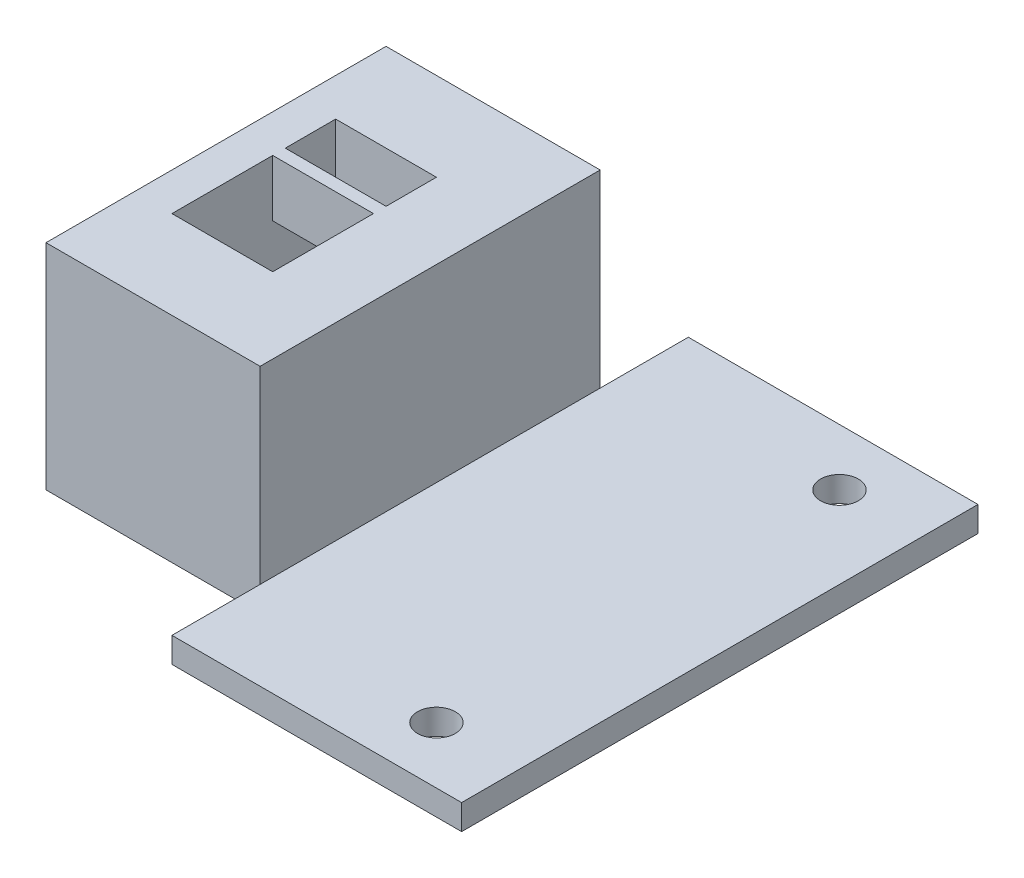
ISO-10303-21;
HEADER;
FILE_DESCRIPTION(('STEP AP214'),'2;1');
FILE_NAME('part.step','',(''),(''),'','','');
FILE_SCHEMA(('AUTOMOTIVE_DESIGN { 1 0 10303 214 1 1 1 1 }'));
ENDSEC;
DATA;
#1=APPLICATION_CONTEXT('core data for automotive mechanical design processes');
#2=APPLICATION_PROTOCOL_DEFINITION('international standard','automotive_design',2000,#1);
#3=PRODUCT_CONTEXT('',#1,'mechanical');
#4=PRODUCT('Part','Part','',(#3));
#5=PRODUCT_RELATED_PRODUCT_CATEGORY('part','',(#4));
#6=PRODUCT_DEFINITION_FORMATION('','',#4);
#7=PRODUCT_DEFINITION_CONTEXT('part definition',#1,'design');
#8=PRODUCT_DEFINITION('design','',#6,#7);
#9=PRODUCT_DEFINITION_SHAPE('','',#8);
#10=(LENGTH_UNIT() NAMED_UNIT(*) SI_UNIT(.MILLI.,.METRE.));
#11=(NAMED_UNIT(*) PLANE_ANGLE_UNIT() SI_UNIT($,.RADIAN.));
#12=(NAMED_UNIT(*) SI_UNIT($,.STERADIAN.) SOLID_ANGLE_UNIT());
#13=UNCERTAINTY_MEASURE_WITH_UNIT(LENGTH_MEASURE(1.E-05),#10,'distance_accuracy_value','');
#14=(GEOMETRIC_REPRESENTATION_CONTEXT(3) GLOBAL_UNCERTAINTY_ASSIGNED_CONTEXT((#13)) GLOBAL_UNIT_ASSIGNED_CONTEXT((#10,
#11,#12)) REPRESENTATION_CONTEXT('',''));
#15=CARTESIAN_POINT('',(0.,0.,0.));
#16=DIRECTION('',(0.,0.,1.));
#17=DIRECTION('',(1.,0.,0.));
#18=AXIS2_PLACEMENT_3D('',#15,#16,#17);
#19=CARTESIAN_POINT('',(-65.3730576602029,23.1868131868132,41.));
#20=DIRECTION('',(1.,0.,0.));
#21=DIRECTION('',(0.,0.,-1.));
#22=AXIS2_PLACEMENT_3D('',#19,#20,#21);
#23=PLANE('',#22);
#24=DIRECTION('',(0.,0.,-1.));
#25=VECTOR('',#24,1.);
#26=CARTESIAN_POINT('',(-65.3730576602029,23.1868131868132,41.));
#27=LINE('',#26,#25);
#28=CARTESIAN_POINT('',(-65.3730576602029,23.1868131868132,34.));
#29=VERTEX_POINT('',#28);
#30=CARTESIAN_POINT('',(-65.3730576602029,23.1868131868132,7.));
#31=VERTEX_POINT('',#30);
#32=EDGE_CURVE('E269',#29,#31,#27,.T.);
#33=ORIENTED_EDGE('',*,*,#32,.T.);
#34=DIRECTION('',(0.,-1.,0.));
#35=VECTOR('',#34,1.);
#36=CARTESIAN_POINT('',(-65.3730576602029,23.1868131868132,7.));
#37=LINE('',#36,#35);
#38=CARTESIAN_POINT('',(-65.3730576602029,6.18681318681318,7.));
#39=VERTEX_POINT('',#38);
#40=EDGE_CURVE('E193',#31,#39,#37,.T.);
#41=ORIENTED_EDGE('',*,*,#40,.T.);
#42=DIRECTION('',(0.,0.,-1.));
#43=VECTOR('',#42,1.);
#44=CARTESIAN_POINT('',(-65.3730576602029,6.18681318681318,41.));
#45=LINE('',#44,#43);
#46=CARTESIAN_POINT('',(-65.3730576602029,6.18681318681318,34.));
#47=VERTEX_POINT('',#46);
#48=EDGE_CURVE('E289',#47,#39,#45,.T.);
#49=ORIENTED_EDGE('',*,*,#48,.F.);
#50=DIRECTION('',(0.,-1.,0.));
#51=VECTOR('',#50,1.);
#52=CARTESIAN_POINT('',(-65.3730576602029,23.1868131868132,34.));
#53=LINE('',#52,#51);
#54=EDGE_CURVE('E206',#29,#47,#53,.T.);
#55=ORIENTED_EDGE('',*,*,#54,.F.);
#56=EDGE_LOOP('',(#33,#41,#49,#55));
#57=FACE_BOUND('',#56,.T.);
#58=ADVANCED_FACE('F33',(#57),#23,.F.);
#59=CARTESIAN_POINT('',(-25.3730576602029,6.18681318681318,41.));
#60=DIRECTION('',(0.,1.,0.));
#61=DIRECTION('',(0.,0.,1.));
#62=AXIS2_PLACEMENT_3D('',#59,#60,#61);
#63=PLANE('',#62);
#64=DIRECTION('',(0.,0.,-1.));
#65=VECTOR('',#64,1.);
#66=CARTESIAN_POINT('',(-62.3730576602029,6.18681318681318,27.));
#67=LINE('',#66,#65);
#68=CARTESIAN_POINT('',(-62.3730576602029,6.18681318681318,27.));
#69=VERTEX_POINT('',#68);
#70=CARTESIAN_POINT('',(-62.3730576602029,6.18681318681318,14.));
#71=VERTEX_POINT('',#70);
#72=EDGE_CURVE('E232',#69,#71,#67,.T.);
#73=ORIENTED_EDGE('',*,*,#72,.F.);
#74=DIRECTION('',(-1.,0.,0.));
#75=VECTOR('',#74,1.);
#76=CARTESIAN_POINT('',(-62.3730576602029,6.18681318681318,27.));
#77=LINE('',#76,#75);
#78=CARTESIAN_POINT('',(-54.3730576602029,6.18681318681318,27.));
#79=VERTEX_POINT('',#78);
#80=EDGE_CURVE('E214',#79,#69,#77,.T.);
#81=ORIENTED_EDGE('',*,*,#80,.F.);
#82=DIRECTION('',(0.,0.,1.));
#83=VECTOR('',#82,1.);
#84=CARTESIAN_POINT('',(-54.3730576602029,6.18681318681318,27.));
#85=LINE('',#84,#83);
#86=CARTESIAN_POINT('',(-54.3730576602029,6.18681318681318,14.));
#87=VERTEX_POINT('',#86);
#88=EDGE_CURVE('E221',#87,#79,#85,.T.);
#89=ORIENTED_EDGE('',*,*,#88,.F.);
#90=DIRECTION('',(1.,0.,0.));
#91=VECTOR('',#90,1.);
#92=CARTESIAN_POINT('',(-62.3730576602029,6.18681318681318,14.));
#93=LINE('',#92,#91);
#94=EDGE_CURVE('E235',#71,#87,#93,.T.);
#95=ORIENTED_EDGE('',*,*,#94,.F.);
#96=EDGE_LOOP('',(#73,#81,#89,#95));
#97=FACE_BOUND('',#96,.T.);
#98=CARTESIAN_POINT('',(-31.8730576602029,6.18681318681318,4.5));
#99=DIRECTION('',(0.,-1.,0.));
#100=DIRECTION('',(0.,0.,-1.));
#101=AXIS2_PLACEMENT_3D('',#98,#99,#100);
#102=CIRCLE('',#101,1.5);
#103=CARTESIAN_POINT('',(-31.8730576602029,6.18681318681318,3.));
#104=VERTEX_POINT('',#103);
#105=EDGE_CURVE('E242',#104,#104,#102,.T.);
#106=ORIENTED_EDGE('',*,*,#105,.F.);
#107=EDGE_LOOP('',(#106));
#108=FACE_BOUND('',#107,.T.);
#109=CARTESIAN_POINT('',(-31.8730576602029,6.18681318681318,36.5));
#110=DIRECTION('',(0.,-1.,0.));
#111=DIRECTION('',(0.,0.,-1.));
#112=AXIS2_PLACEMENT_3D('',#109,#110,#111);
#113=CIRCLE('',#112,1.5);
#114=CARTESIAN_POINT('',(-31.8730576602029,6.18681318681318,35.));
#115=VERTEX_POINT('',#114);
#116=EDGE_CURVE('E252',#115,#115,#113,.T.);
#117=ORIENTED_EDGE('',*,*,#116,.F.);
#118=EDGE_LOOP('',(#117));
#119=FACE_BOUND('',#118,.T.);
#120=ORIENTED_EDGE('',*,*,#48,.T.);
#121=DIRECTION('',(-1.,0.,0.));
#122=VECTOR('',#121,1.);
#123=CARTESIAN_POINT('',(-65.3730576602029,6.18681318681318,7.));
#124=LINE('',#123,#122);
#125=CARTESIAN_POINT('',(-48.3730576602029,6.18681318681318,7.));
#126=VERTEX_POINT('',#125);
#127=EDGE_CURVE('E189',#126,#39,#124,.T.);
#128=ORIENTED_EDGE('',*,*,#127,.F.);
#129=DIRECTION('',(0.,0.,1.));
#130=VECTOR('',#129,1.);
#131=CARTESIAN_POINT('',(-48.3730576602029,6.18681318681318,0.));
#132=LINE('',#131,#130);
#133=CARTESIAN_POINT('',(-48.3730576602029,6.18681318681318,0.));
#134=VERTEX_POINT('',#133);
#135=EDGE_CURVE('E180',#134,#126,#132,.T.);
#136=ORIENTED_EDGE('',*,*,#135,.F.);
#137=DIRECTION('',(1.,0.,0.));
#138=VECTOR('',#137,1.);
#139=CARTESIAN_POINT('',(-25.3730576602029,6.18681318681318,0.));
#140=LINE('',#139,#138);
#141=CARTESIAN_POINT('',(-25.3730576602029,6.18681318681318,0.));
#142=VERTEX_POINT('',#141);
#143=EDGE_CURVE('E258',#134,#142,#140,.T.);
#144=ORIENTED_EDGE('',*,*,#143,.T.);
#145=DIRECTION('',(0.,0.,-1.));
#146=VECTOR('',#145,1.);
#147=CARTESIAN_POINT('',(-25.3730576602029,6.18681318681318,41.));
#148=LINE('',#147,#146);
#149=CARTESIAN_POINT('',(-25.3730576602029,6.18681318681318,41.));
#150=VERTEX_POINT('',#149);
#151=EDGE_CURVE('E286',#150,#142,#148,.T.);
#152=ORIENTED_EDGE('',*,*,#151,.F.);
#153=DIRECTION('',(1.,0.,0.));
#154=VECTOR('',#153,1.);
#155=CARTESIAN_POINT('',(-25.3730576602029,6.18681318681318,41.));
#156=LINE('',#155,#154);
#157=CARTESIAN_POINT('',(-48.3730576602029,6.18681318681318,41.));
#158=VERTEX_POINT('',#157);
#159=EDGE_CURVE('E261',#158,#150,#156,.T.);
#160=ORIENTED_EDGE('',*,*,#159,.F.);
#161=DIRECTION('',(0.,0.,1.));
#162=VECTOR('',#161,1.);
#163=CARTESIAN_POINT('',(-48.3730576602029,6.18681318681318,41.));
#164=LINE('',#163,#162);
#165=CARTESIAN_POINT('',(-48.3730576602029,6.18681318681318,34.));
#166=VERTEX_POINT('',#165);
#167=EDGE_CURVE('E207',#166,#158,#164,.T.);
#168=ORIENTED_EDGE('',*,*,#167,.F.);
#169=DIRECTION('',(1.,0.,0.));
#170=VECTOR('',#169,1.);
#171=CARTESIAN_POINT('',(-65.3730576602029,6.18681318681318,34.));
#172=LINE('',#171,#170);
#173=EDGE_CURVE('E202',#47,#166,#172,.T.);
#174=ORIENTED_EDGE('',*,*,#173,.F.);
#175=EDGE_LOOP('',(#120,#128,#136,#144,#152,#160,#168,#174));
#176=FACE_BOUND('',#175,.T.);
#177=ADVANCED_FACE('F301',(#97,#108,#119,#176),#63,.F.);
#178=CARTESIAN_POINT('',(-25.3730576602029,8.18681318681318,41.));
#179=DIRECTION('',(-1.,0.,0.));
#180=DIRECTION('',(0.,0.,1.));
#181=AXIS2_PLACEMENT_3D('',#178,#179,#180);
#182=PLANE('',#181);
#183=DIRECTION('',(0.,1.,0.));
#184=VECTOR('',#183,1.);
#185=CARTESIAN_POINT('',(-25.3730576602029,8.18681318681318,0.));
#186=LINE('',#185,#184);
#187=CARTESIAN_POINT('',(-25.3730576602029,8.18681318681318,0.));
#188=VERTEX_POINT('',#187);
#189=EDGE_CURVE('E271',#142,#188,#186,.T.);
#190=ORIENTED_EDGE('',*,*,#189,.T.);
#191=DIRECTION('',(0.,0.,-1.));
#192=VECTOR('',#191,1.);
#193=CARTESIAN_POINT('',(-25.3730576602029,8.18681318681318,41.));
#194=LINE('',#193,#192);
#195=CARTESIAN_POINT('',(-25.3730576602029,8.18681318681318,41.));
#196=VERTEX_POINT('',#195);
#197=EDGE_CURVE('E283',#196,#188,#194,.T.);
#198=ORIENTED_EDGE('',*,*,#197,.F.);
#199=DIRECTION('',(0.,1.,0.));
#200=VECTOR('',#199,1.);
#201=CARTESIAN_POINT('',(-25.3730576602029,8.18681318681318,41.));
#202=LINE('',#201,#200);
#203=EDGE_CURVE('E263',#150,#196,#202,.T.);
#204=ORIENTED_EDGE('',*,*,#203,.F.);
#205=ORIENTED_EDGE('',*,*,#151,.T.);
#206=EDGE_LOOP('',(#190,#198,#204,#205));
#207=FACE_BOUND('',#206,.T.);
#208=ADVANCED_FACE('F309',(#207),#182,.F.);
#209=CARTESIAN_POINT('',(-48.3730576602029,8.18681318681318,41.));
#210=DIRECTION('',(0.,-1.,0.));
#211=DIRECTION('',(0.,0.,-1.));
#212=AXIS2_PLACEMENT_3D('',#209,#210,#211);
#213=PLANE('',#212);
#214=CARTESIAN_POINT('',(-31.8730576602029,8.18681318681318,4.5));
#215=DIRECTION('',(0.,-1.,0.));
#216=DIRECTION('',(0.,0.,-1.));
#217=AXIS2_PLACEMENT_3D('',#214,#215,#216);
#218=CIRCLE('',#217,1.5);
#219=CARTESIAN_POINT('',(-31.8730576602029,8.18681318681318,3.));
#220=VERTEX_POINT('',#219);
#221=EDGE_CURVE('E249',#220,#220,#218,.T.);
#222=ORIENTED_EDGE('',*,*,#221,.T.);
#223=EDGE_LOOP('',(#222));
#224=FACE_BOUND('',#223,.T.);
#225=CARTESIAN_POINT('',(-31.8730576602029,8.18681318681318,36.5));
#226=DIRECTION('',(0.,-1.,0.));
#227=DIRECTION('',(0.,0.,-1.));
#228=AXIS2_PLACEMENT_3D('',#225,#226,#227);
#229=CIRCLE('',#228,1.5);
#230=CARTESIAN_POINT('',(-31.8730576602029,8.18681318681318,35.));
#231=VERTEX_POINT('',#230);
#232=EDGE_CURVE('E255',#231,#231,#229,.T.);
#233=ORIENTED_EDGE('',*,*,#232,.T.);
#234=EDGE_LOOP('',(#233));
#235=FACE_BOUND('',#234,.T.);
#236=DIRECTION('',(-1.,0.,0.));
#237=VECTOR('',#236,1.);
#238=CARTESIAN_POINT('',(-48.3730576602029,8.18681318681318,0.));
#239=LINE('',#238,#237);
#240=CARTESIAN_POINT('',(-48.3730576602029,8.18681318681318,0.));
#241=VERTEX_POINT('',#240);
#242=EDGE_CURVE('E264',#188,#241,#239,.T.);
#243=ORIENTED_EDGE('',*,*,#242,.T.);
#244=DIRECTION('',(0.,0.,1.));
#245=VECTOR('',#244,1.);
#246=CARTESIAN_POINT('',(-48.3730576602029,8.18681318681318,41.));
#247=LINE('',#246,#245);
#248=CARTESIAN_POINT('',(-48.3730576602029,8.18681318681318,7.));
#249=VERTEX_POINT('',#248);
#250=EDGE_CURVE('E196',#241,#249,#247,.T.);
#251=ORIENTED_EDGE('',*,*,#250,.T.);
#252=DIRECTION('',(0.,0.,-1.));
#253=VECTOR('',#252,1.);
#254=CARTESIAN_POINT('',(-48.3730576602029,8.18681318681318,41.));
#255=LINE('',#254,#253);
#256=CARTESIAN_POINT('',(-48.3730576602029,8.18681318681318,34.));
#257=VERTEX_POINT('',#256);
#258=EDGE_CURVE('E280',#257,#249,#255,.T.);
#259=ORIENTED_EDGE('',*,*,#258,.F.);
#260=CARTESIAN_POINT('',(-48.3730576602029,8.18681318681318,41.));
#261=VERTEX_POINT('',#260);
#262=EDGE_CURVE('E281',#261,#257,#255,.T.);
#263=ORIENTED_EDGE('',*,*,#262,.F.);
#264=DIRECTION('',(-1.,0.,0.));
#265=VECTOR('',#264,1.);
#266=CARTESIAN_POINT('',(-48.3730576602029,8.18681318681318,41.));
#267=LINE('',#266,#265);
#268=EDGE_CURVE('E266',#196,#261,#267,.T.);
#269=ORIENTED_EDGE('',*,*,#268,.F.);
#270=ORIENTED_EDGE('',*,*,#197,.T.);
#271=EDGE_LOOP('',(#243,#251,#259,#263,#269,#270));
#272=FACE_BOUND('',#271,.T.);
#273=ADVANCED_FACE('F312',(#224,#235,#272),#213,.F.);
#274=CARTESIAN_POINT('',(-48.3730576602029,23.1868131868132,41.));
#275=DIRECTION('',(-1.,0.,0.));
#276=DIRECTION('',(0.,0.,1.));
#277=AXIS2_PLACEMENT_3D('',#274,#275,#276);
#278=PLANE('',#277);
#279=ORIENTED_EDGE('',*,*,#258,.T.);
#280=DIRECTION('',(0.,-1.,0.));
#281=VECTOR('',#280,1.);
#282=CARTESIAN_POINT('',(-48.3730576602029,23.1868131868132,7.));
#283=LINE('',#282,#281);
#284=CARTESIAN_POINT('',(-48.3730576602029,23.1868131868132,7.));
#285=VERTEX_POINT('',#284);
#286=EDGE_CURVE('E197',#285,#249,#283,.T.);
#287=ORIENTED_EDGE('',*,*,#286,.F.);
#288=DIRECTION('',(0.,0.,-1.));
#289=VECTOR('',#288,1.);
#290=CARTESIAN_POINT('',(-48.3730576602029,23.1868131868132,41.));
#291=LINE('',#290,#289);
#292=CARTESIAN_POINT('',(-48.3730576602029,23.1868131868132,34.));
#293=VERTEX_POINT('',#292);
#294=EDGE_CURVE('E277',#293,#285,#291,.T.);
#295=ORIENTED_EDGE('',*,*,#294,.F.);
#296=DIRECTION('',(0.,-1.,0.));
#297=VECTOR('',#296,1.);
#298=CARTESIAN_POINT('',(-48.3730576602029,23.1868131868132,34.));
#299=LINE('',#298,#297);
#300=EDGE_CURVE('E211',#293,#257,#299,.T.);
#301=ORIENTED_EDGE('',*,*,#300,.T.);
#302=EDGE_LOOP('',(#279,#287,#295,#301));
#303=FACE_BOUND('',#302,.T.);
#304=ADVANCED_FACE('F321',(#303),#278,.F.);
#305=CARTESIAN_POINT('',(-65.3730576602029,23.1868131868132,41.));
#306=DIRECTION('',(0.,-1.,0.));
#307=DIRECTION('',(0.,0.,-1.));
#308=AXIS2_PLACEMENT_3D('',#305,#306,#307);
#309=PLANE('',#308);
#310=DIRECTION('',(0.,0.,1.));
#311=VECTOR('',#310,1.);
#312=CARTESIAN_POINT('',(-54.3730576602029,23.1868131868132,27.));
#313=LINE('',#312,#311);
#314=CARTESIAN_POINT('',(-54.3730576602029,23.1868131868132,14.));
#315=VERTEX_POINT('',#314);
#316=CARTESIAN_POINT('',(-54.3730576602029,23.1868131868132,18.));
#317=VERTEX_POINT('',#316);
#318=EDGE_CURVE('E228',#315,#317,#313,.T.);
#319=ORIENTED_EDGE('',*,*,#318,.T.);
#320=DIRECTION('',(-1.,0.,0.));
#321=VECTOR('',#320,1.);
#322=CARTESIAN_POINT('',(-54.3730576602029,23.1868131868132,18.));
#323=LINE('',#322,#321);
#324=CARTESIAN_POINT('',(-62.3730576602029,23.1868131868132,18.));
#325=VERTEX_POINT('',#324);
#326=EDGE_CURVE('E55',#317,#325,#323,.T.);
#327=ORIENTED_EDGE('',*,*,#326,.T.);
#328=DIRECTION('',(0.,0.,-1.));
#329=VECTOR('',#328,1.);
#330=CARTESIAN_POINT('',(-62.3730576602029,23.1868131868132,27.));
#331=LINE('',#330,#329);
#332=CARTESIAN_POINT('',(-62.3730576602029,23.1868131868132,14.));
#333=VERTEX_POINT('',#332);
#334=EDGE_CURVE('E220',#325,#333,#331,.T.);
#335=ORIENTED_EDGE('',*,*,#334,.T.);
#336=DIRECTION('',(1.,0.,0.));
#337=VECTOR('',#336,1.);
#338=CARTESIAN_POINT('',(-62.3730576602029,23.1868131868132,14.));
#339=LINE('',#338,#337);
#340=EDGE_CURVE('E224',#333,#315,#339,.T.);
#341=ORIENTED_EDGE('',*,*,#340,.T.);
#342=EDGE_LOOP('',(#319,#327,#335,#341));
#343=FACE_BOUND('',#342,.T.);
#344=DIRECTION('',(1.,0.,0.));
#345=VECTOR('',#344,1.);
#346=CARTESIAN_POINT('',(-54.3730576602029,23.1868131868132,19.));
#347=LINE('',#346,#345);
#348=CARTESIAN_POINT('',(-62.3730576602029,23.1868131868132,19.));
#349=VERTEX_POINT('',#348);
#350=CARTESIAN_POINT('',(-54.3730576602029,23.1868131868132,19.));
#351=VERTEX_POINT('',#350);
#352=EDGE_CURVE('E47',#349,#351,#347,.T.);
#353=ORIENTED_EDGE('',*,*,#352,.T.);
#354=CARTESIAN_POINT('',(-54.3730576602029,23.1868131868132,27.));
#355=VERTEX_POINT('',#354);
#356=EDGE_CURVE('E227',#351,#355,#313,.T.);
#357=ORIENTED_EDGE('',*,*,#356,.T.);
#358=DIRECTION('',(-1.,0.,0.));
#359=VECTOR('',#358,1.);
#360=CARTESIAN_POINT('',(-62.3730576602029,23.1868131868132,27.));
#361=LINE('',#360,#359);
#362=CARTESIAN_POINT('',(-62.3730576602029,23.1868131868132,27.));
#363=VERTEX_POINT('',#362);
#364=EDGE_CURVE('E217',#355,#363,#361,.T.);
#365=ORIENTED_EDGE('',*,*,#364,.T.);
#366=EDGE_CURVE('E222',#363,#349,#331,.T.);
#367=ORIENTED_EDGE('',*,*,#366,.T.);
#368=EDGE_LOOP('',(#353,#357,#365,#367));
#369=FACE_BOUND('',#368,.T.);
#370=ORIENTED_EDGE('',*,*,#294,.T.);
#371=DIRECTION('',(-1.,0.,0.));
#372=VECTOR('',#371,1.);
#373=CARTESIAN_POINT('',(-65.3730576602029,23.1868131868132,7.));
#374=LINE('',#373,#372);
#375=EDGE_CURVE('E185',#285,#31,#374,.T.);
#376=ORIENTED_EDGE('',*,*,#375,.T.);
#377=ORIENTED_EDGE('',*,*,#32,.F.);
#378=DIRECTION('',(1.,0.,0.));
#379=VECTOR('',#378,1.);
#380=CARTESIAN_POINT('',(-65.3730576602029,23.1868131868132,34.));
#381=LINE('',#380,#379);
#382=EDGE_CURVE('E203',#29,#293,#381,.T.);
#383=ORIENTED_EDGE('',*,*,#382,.T.);
#384=EDGE_LOOP('',(#370,#376,#377,#383));
#385=FACE_BOUND('',#384,.T.);
#386=ADVANCED_FACE('F324',(#343,#369,#385),#309,.F.);
#387=CARTESIAN_POINT('',(0.,0.,41.));
#388=DIRECTION('',(0.,0.,-1.));
#389=DIRECTION('',(-1.,0.,0.));
#390=AXIS2_PLACEMENT_3D('',#387,#388,#389);
#391=PLANE('',#390);
#392=ORIENTED_EDGE('',*,*,#268,.T.);
#393=DIRECTION('',(0.,-1.,0.));
#394=VECTOR('',#393,1.);
#395=CARTESIAN_POINT('',(-48.3730576602029,0.,41.));
#396=LINE('',#395,#394);
#397=EDGE_CURVE('E40',#261,#158,#396,.T.);
#398=ORIENTED_EDGE('',*,*,#397,.T.);
#399=ORIENTED_EDGE('',*,*,#159,.T.);
#400=ORIENTED_EDGE('',*,*,#203,.T.);
#401=EDGE_LOOP('',(#392,#398,#399,#400));
#402=FACE_BOUND('',#401,.T.);
#403=ADVANCED_FACE('F294',(#402),#391,.F.);
#404=CARTESIAN_POINT('',(0.,0.,0.));
#405=DIRECTION('',(0.,0.,-1.));
#406=DIRECTION('',(-1.,0.,0.));
#407=AXIS2_PLACEMENT_3D('',#404,#405,#406);
#408=PLANE('',#407);
#409=DIRECTION('',(0.,-1.,0.));
#410=VECTOR('',#409,1.);
#411=CARTESIAN_POINT('',(-48.3730576602029,0.,0.));
#412=LINE('',#411,#410);
#413=EDGE_CURVE('E11',#241,#134,#412,.T.);
#414=ORIENTED_EDGE('',*,*,#413,.F.);
#415=ORIENTED_EDGE('',*,*,#242,.F.);
#416=ORIENTED_EDGE('',*,*,#189,.F.);
#417=ORIENTED_EDGE('',*,*,#143,.F.);
#418=EDGE_LOOP('',(#414,#415,#416,#417));
#419=FACE_BOUND('',#418,.T.);
#420=ADVANCED_FACE('F336',(#419),#408,.T.);
#421=CARTESIAN_POINT('',(-31.8730576602029,8.18681318681318,36.5));
#422=DIRECTION('',(0.,-1.,0.));
#423=DIRECTION('',(0.,0.,-1.));
#424=AXIS2_PLACEMENT_3D('',#421,#422,#423);
#425=CYLINDRICAL_SURFACE('',#424,1.5);
#426=ORIENTED_EDGE('',*,*,#232,.F.);
#427=EDGE_LOOP('',(#426));
#428=FACE_BOUND('',#427,.T.);
#429=ORIENTED_EDGE('',*,*,#116,.T.);
#430=EDGE_LOOP('',(#429));
#431=FACE_BOUND('',#430,.T.);
#432=ADVANCED_FACE('F338',(#428,#431),#425,.F.);
#433=CARTESIAN_POINT('',(-31.8730576602029,8.18681318681318,4.5));
#434=DIRECTION('',(0.,-1.,0.));
#435=DIRECTION('',(0.,0.,-1.));
#436=AXIS2_PLACEMENT_3D('',#433,#434,#435);
#437=CYLINDRICAL_SURFACE('',#436,1.5);
#438=ORIENTED_EDGE('',*,*,#221,.F.);
#439=EDGE_LOOP('',(#438));
#440=FACE_BOUND('',#439,.T.);
#441=ORIENTED_EDGE('',*,*,#105,.T.);
#442=EDGE_LOOP('',(#441));
#443=FACE_BOUND('',#442,.T.);
#444=ADVANCED_FACE('F344',(#440,#443),#437,.F.);
#445=CARTESIAN_POINT('',(-62.3730576602029,23.1868131868132,27.));
#446=DIRECTION('',(0.,0.,1.));
#447=DIRECTION('',(1.,0.,0.));
#448=AXIS2_PLACEMENT_3D('',#445,#446,#447);
#449=PLANE('',#448);
#450=ORIENTED_EDGE('',*,*,#80,.T.);
#451=DIRECTION('',(0.,-1.,0.));
#452=VECTOR('',#451,1.);
#453=CARTESIAN_POINT('',(-62.3730576602029,23.1868131868132,27.));
#454=LINE('',#453,#452);
#455=EDGE_CURVE('E230',#363,#69,#454,.T.);
#456=ORIENTED_EDGE('',*,*,#455,.F.);
#457=ORIENTED_EDGE('',*,*,#364,.F.);
#458=DIRECTION('',(0.,-1.,0.));
#459=VECTOR('',#458,1.);
#460=CARTESIAN_POINT('',(-54.3730576602029,23.1868131868132,27.));
#461=LINE('',#460,#459);
#462=EDGE_CURVE('E240',#355,#79,#461,.T.);
#463=ORIENTED_EDGE('',*,*,#462,.T.);
#464=EDGE_LOOP('',(#450,#456,#457,#463));
#465=FACE_BOUND('',#464,.T.);
#466=ADVANCED_FACE('F377',(#465),#449,.F.);
#467=CARTESIAN_POINT('',(-54.3730576602029,23.1868131868132,27.));
#468=DIRECTION('',(1.,0.,0.));
#469=DIRECTION('',(0.,0.,-1.));
#470=AXIS2_PLACEMENT_3D('',#467,#468,#469);
#471=PLANE('',#470);
#472=ORIENTED_EDGE('',*,*,#356,.F.);
#473=DIRECTION('',(0.,1.,0.));
#474=VECTOR('',#473,1.);
#475=CARTESIAN_POINT('',(-54.3730576602029,18.6868131868132,19.));
#476=LINE('',#475,#474);
#477=CARTESIAN_POINT('',(-54.3730576602029,18.6868131868132,19.));
#478=VERTEX_POINT('',#477);
#479=EDGE_CURVE('E172',#478,#351,#476,.T.);
#480=ORIENTED_EDGE('',*,*,#479,.F.);
#481=DIRECTION('',(0.,0.,-1.));
#482=VECTOR('',#481,1.);
#483=CARTESIAN_POINT('',(-54.3730576602029,18.6868131868132,19.));
#484=LINE('',#483,#482);
#485=CARTESIAN_POINT('',(-54.3730576602029,18.6868131868132,18.));
#486=VERTEX_POINT('',#485);
#487=EDGE_CURVE('E164',#478,#486,#484,.T.);
#488=ORIENTED_EDGE('',*,*,#487,.T.);
#489=DIRECTION('',(0.,1.,0.));
#490=VECTOR('',#489,1.);
#491=CARTESIAN_POINT('',(-54.3730576602029,18.6868131868132,18.));
#492=LINE('',#491,#490);
#493=EDGE_CURVE('E150',#486,#317,#492,.T.);
#494=ORIENTED_EDGE('',*,*,#493,.T.);
#495=ORIENTED_EDGE('',*,*,#318,.F.);
#496=DIRECTION('',(0.,-1.,0.));
#497=VECTOR('',#496,1.);
#498=CARTESIAN_POINT('',(-54.3730576602029,23.1868131868132,14.));
#499=LINE('',#498,#497);
#500=EDGE_CURVE('E243',#315,#87,#499,.T.);
#501=ORIENTED_EDGE('',*,*,#500,.T.);
#502=ORIENTED_EDGE('',*,*,#88,.T.);
#503=ORIENTED_EDGE('',*,*,#462,.F.);
#504=EDGE_LOOP('',(#472,#480,#488,#494,#495,#501,#502,#503));
#505=FACE_BOUND('',#504,.T.);
#506=ADVANCED_FACE('F171',(#505),#471,.F.);
#507=CARTESIAN_POINT('',(-62.3730576602029,23.1868131868132,14.));
#508=DIRECTION('',(0.,0.,-1.));
#509=DIRECTION('',(-1.,0.,0.));
#510=AXIS2_PLACEMENT_3D('',#507,#508,#509);
#511=PLANE('',#510);
#512=ORIENTED_EDGE('',*,*,#94,.T.);
#513=ORIENTED_EDGE('',*,*,#500,.F.);
#514=ORIENTED_EDGE('',*,*,#340,.F.);
#515=DIRECTION('',(0.,-1.,0.));
#516=VECTOR('',#515,1.);
#517=CARTESIAN_POINT('',(-62.3730576602029,23.1868131868132,14.));
#518=LINE('',#517,#516);
#519=EDGE_CURVE('E245',#333,#71,#518,.T.);
#520=ORIENTED_EDGE('',*,*,#519,.T.);
#521=EDGE_LOOP('',(#512,#513,#514,#520));
#522=FACE_BOUND('',#521,.T.);
#523=ADVANCED_FACE('F374',(#522),#511,.F.);
#524=CARTESIAN_POINT('',(-62.3730576602029,23.1868131868132,27.));
#525=DIRECTION('',(-1.,0.,0.));
#526=DIRECTION('',(0.,0.,1.));
#527=AXIS2_PLACEMENT_3D('',#524,#525,#526);
#528=PLANE('',#527);
#529=DIRECTION('',(0.,0.,1.));
#530=VECTOR('',#529,1.);
#531=CARTESIAN_POINT('',(-62.3730576602029,18.6868131868132,19.));
#532=LINE('',#531,#530);
#533=CARTESIAN_POINT('',(-62.3730576602029,18.6868131868132,18.));
#534=VERTEX_POINT('',#533);
#535=CARTESIAN_POINT('',(-62.3730576602029,18.6868131868132,19.));
#536=VERTEX_POINT('',#535);
#537=EDGE_CURVE('E167',#534,#536,#532,.T.);
#538=ORIENTED_EDGE('',*,*,#537,.T.);
#539=DIRECTION('',(0.,1.,0.));
#540=VECTOR('',#539,1.);
#541=CARTESIAN_POINT('',(-62.3730576602029,18.6868131868132,19.));
#542=LINE('',#541,#540);
#543=EDGE_CURVE('E181',#536,#349,#542,.T.);
#544=ORIENTED_EDGE('',*,*,#543,.T.);
#545=ORIENTED_EDGE('',*,*,#366,.F.);
#546=ORIENTED_EDGE('',*,*,#455,.T.);
#547=ORIENTED_EDGE('',*,*,#72,.T.);
#548=ORIENTED_EDGE('',*,*,#519,.F.);
#549=ORIENTED_EDGE('',*,*,#334,.F.);
#550=DIRECTION('',(0.,1.,0.));
#551=VECTOR('',#550,1.);
#552=CARTESIAN_POINT('',(-62.3730576602029,18.6868131868132,18.));
#553=LINE('',#552,#551);
#554=EDGE_CURVE('E158',#534,#325,#553,.T.);
#555=ORIENTED_EDGE('',*,*,#554,.F.);
#556=EDGE_LOOP('',(#538,#544,#545,#546,#547,#548,#549,#555));
#557=FACE_BOUND('',#556,.T.);
#558=ADVANCED_FACE('F381',(#557),#528,.F.);
#559=CARTESIAN_POINT('',(-48.3730576602029,23.1868131868132,41.));
#560=DIRECTION('',(1.,0.,0.));
#561=DIRECTION('',(0.,0.,-1.));
#562=AXIS2_PLACEMENT_3D('',#559,#560,#561);
#563=PLANE('',#562);
#564=EDGE_CURVE('E215',#257,#166,#299,.T.);
#565=ORIENTED_EDGE('',*,*,#564,.T.);
#566=ORIENTED_EDGE('',*,*,#167,.T.);
#567=ORIENTED_EDGE('',*,*,#397,.F.);
#568=ORIENTED_EDGE('',*,*,#262,.T.);
#569=EDGE_LOOP('',(#565,#566,#567,#568));
#570=FACE_BOUND('',#569,.T.);
#571=ADVANCED_FACE('F316',(#570),#563,.F.);
#572=CARTESIAN_POINT('',(-65.3730576602029,23.1868131868132,34.));
#573=DIRECTION('',(0.,0.,-1.));
#574=DIRECTION('',(-1.,0.,0.));
#575=AXIS2_PLACEMENT_3D('',#572,#573,#574);
#576=PLANE('',#575);
#577=ORIENTED_EDGE('',*,*,#173,.T.);
#578=ORIENTED_EDGE('',*,*,#564,.F.);
#579=ORIENTED_EDGE('',*,*,#300,.F.);
#580=ORIENTED_EDGE('',*,*,#382,.F.);
#581=ORIENTED_EDGE('',*,*,#54,.T.);
#582=EDGE_LOOP('',(#577,#578,#579,#580,#581));
#583=FACE_BOUND('',#582,.T.);
#584=ADVANCED_FACE('F318',(#583),#576,.F.);
#585=CARTESIAN_POINT('',(-48.3730576602029,23.1868131868132,0.));
#586=DIRECTION('',(1.,0.,0.));
#587=DIRECTION('',(0.,0.,-1.));
#588=AXIS2_PLACEMENT_3D('',#585,#586,#587);
#589=PLANE('',#588);
#590=ORIENTED_EDGE('',*,*,#413,.T.);
#591=ORIENTED_EDGE('',*,*,#135,.T.);
#592=EDGE_CURVE('E188',#249,#126,#283,.T.);
#593=ORIENTED_EDGE('',*,*,#592,.F.);
#594=ORIENTED_EDGE('',*,*,#250,.F.);
#595=EDGE_LOOP('',(#590,#591,#593,#594));
#596=FACE_BOUND('',#595,.T.);
#597=ADVANCED_FACE('F333',(#596),#589,.F.);
#598=CARTESIAN_POINT('',(-65.3730576602029,23.1868131868132,7.));
#599=DIRECTION('',(0.,0.,1.));
#600=DIRECTION('',(1.,0.,0.));
#601=AXIS2_PLACEMENT_3D('',#598,#599,#600);
#602=PLANE('',#601);
#603=ORIENTED_EDGE('',*,*,#127,.T.);
#604=ORIENTED_EDGE('',*,*,#40,.F.);
#605=ORIENTED_EDGE('',*,*,#375,.F.);
#606=ORIENTED_EDGE('',*,*,#286,.T.);
#607=ORIENTED_EDGE('',*,*,#592,.T.);
#608=EDGE_LOOP('',(#603,#604,#605,#606,#607));
#609=FACE_BOUND('',#608,.T.);
#610=ADVANCED_FACE('F331',(#609),#602,.F.);
#611=CARTESIAN_POINT('',(-54.3730576602029,18.6868131868132,19.));
#612=DIRECTION('',(0.,0.,1.));
#613=DIRECTION('',(1.,0.,0.));
#614=AXIS2_PLACEMENT_3D('',#611,#612,#613);
#615=PLANE('',#614);
#616=ORIENTED_EDGE('',*,*,#352,.F.);
#617=ORIENTED_EDGE('',*,*,#543,.F.);
#618=DIRECTION('',(1.,0.,0.));
#619=VECTOR('',#618,1.);
#620=CARTESIAN_POINT('',(-54.3730576602029,18.6868131868132,19.));
#621=LINE('',#620,#619);
#622=EDGE_CURVE('E159',#536,#478,#621,.T.);
#623=ORIENTED_EDGE('',*,*,#622,.T.);
#624=ORIENTED_EDGE('',*,*,#479,.T.);
#625=EDGE_LOOP('',(#616,#617,#623,#624));
#626=FACE_BOUND('',#625,.T.);
#627=ADVANCED_FACE('F383',(#626),#615,.T.);
#628=CARTESIAN_POINT('',(-54.3730576602029,18.6868131868132,18.));
#629=DIRECTION('',(0.,0.,-1.));
#630=DIRECTION('',(-1.,0.,0.));
#631=AXIS2_PLACEMENT_3D('',#628,#629,#630);
#632=PLANE('',#631);
#633=ORIENTED_EDGE('',*,*,#326,.F.);
#634=ORIENTED_EDGE('',*,*,#493,.F.);
#635=DIRECTION('',(-1.,0.,0.));
#636=VECTOR('',#635,1.);
#637=CARTESIAN_POINT('',(-54.3730576602029,18.6868131868132,18.));
#638=LINE('',#637,#636);
#639=EDGE_CURVE('E153',#486,#534,#638,.T.);
#640=ORIENTED_EDGE('',*,*,#639,.T.);
#641=ORIENTED_EDGE('',*,*,#554,.T.);
#642=EDGE_LOOP('',(#633,#634,#640,#641));
#643=FACE_BOUND('',#642,.T.);
#644=ADVANCED_FACE('F152',(#643),#632,.T.);
#645=CARTESIAN_POINT('',(0.,18.6868131868132,0.));
#646=DIRECTION('',(0.,1.,0.));
#647=DIRECTION('',(0.,0.,1.));
#648=AXIS2_PLACEMENT_3D('',#645,#646,#647);
#649=PLANE('',#648);
#650=ORIENTED_EDGE('',*,*,#487,.F.);
#651=ORIENTED_EDGE('',*,*,#622,.F.);
#652=ORIENTED_EDGE('',*,*,#537,.F.);
#653=ORIENTED_EDGE('',*,*,#639,.F.);
#654=EDGE_LOOP('',(#650,#651,#652,#653));
#655=FACE_BOUND('',#654,.T.);
#656=ADVANCED_FACE('F162',(#655),#649,.F.);
#657=CLOSED_SHELL('',(#58,#177,#208,#273,#304,#386,#403,#420,#432,#444,#466,#506,#523,#558,#571,
#584,#597,#610,#627,#644,#656));
#658=MANIFOLD_SOLID_BREP('B2',#657);
#659=ADVANCED_BREP_SHAPE_REPRESENTATION('',(#18,#658),#14);
#660=SHAPE_DEFINITION_REPRESENTATION(#9,#659);
ENDSEC;
END-ISO-10303-21;
